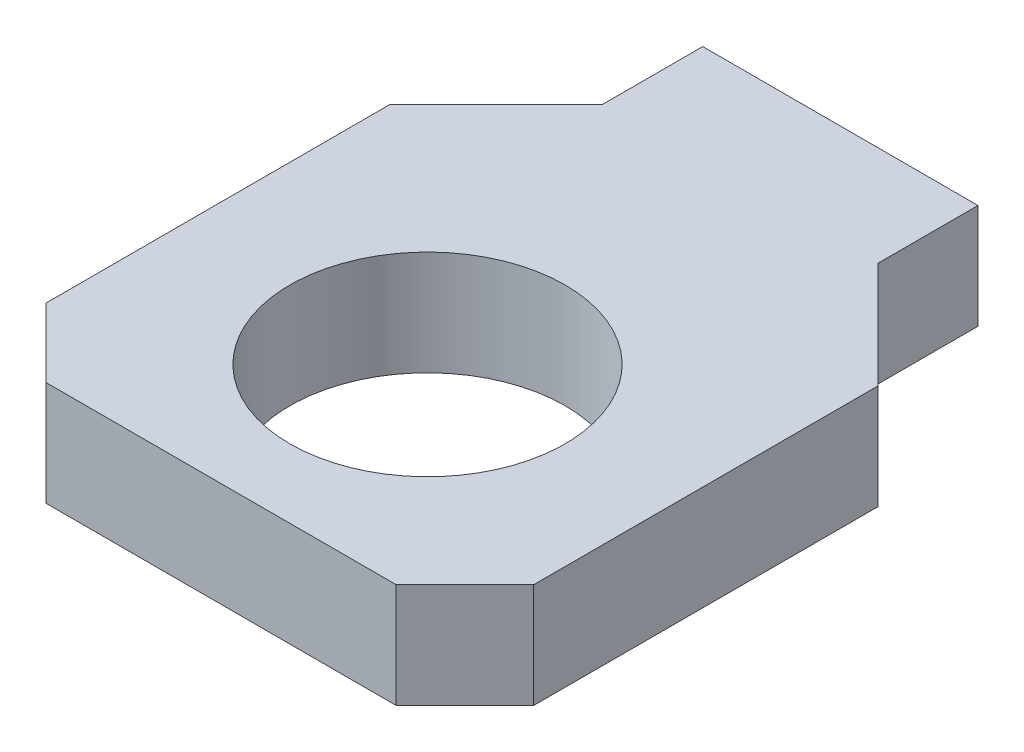
ISO-10303-21;
HEADER;
FILE_DESCRIPTION(('STEP AP214'),'2;1');
FILE_NAME('part.step','',(''),(''),'','','');
FILE_SCHEMA(('AUTOMOTIVE_DESIGN { 1 0 10303 214 1 1 1 1 }'));
ENDSEC;
DATA;
#1=APPLICATION_CONTEXT('core data for automotive mechanical design processes');
#2=APPLICATION_PROTOCOL_DEFINITION('international standard','automotive_design',2000,#1);
#3=PRODUCT_CONTEXT('',#1,'mechanical');
#4=PRODUCT('Part','Part','',(#3));
#5=PRODUCT_RELATED_PRODUCT_CATEGORY('part','',(#4));
#6=PRODUCT_DEFINITION_FORMATION('','',#4);
#7=PRODUCT_DEFINITION_CONTEXT('part definition',#1,'design');
#8=PRODUCT_DEFINITION('design','',#6,#7);
#9=PRODUCT_DEFINITION_SHAPE('','',#8);
#10=(LENGTH_UNIT() NAMED_UNIT(*) SI_UNIT(.MILLI.,.METRE.));
#11=(NAMED_UNIT(*) PLANE_ANGLE_UNIT() SI_UNIT($,.RADIAN.));
#12=(NAMED_UNIT(*) SI_UNIT($,.STERADIAN.) SOLID_ANGLE_UNIT());
#13=UNCERTAINTY_MEASURE_WITH_UNIT(LENGTH_MEASURE(1.E-05),#10,'distance_accuracy_value','');
#14=(GEOMETRIC_REPRESENTATION_CONTEXT(3) GLOBAL_UNCERTAINTY_ASSIGNED_CONTEXT((#13)) GLOBAL_UNIT_ASSIGNED_CONTEXT((#10,
#11,#12)) REPRESENTATION_CONTEXT('',''));
#15=CARTESIAN_POINT('',(0.,0.,0.));
#16=DIRECTION('',(0.,0.,1.));
#17=DIRECTION('',(1.,0.,0.));
#18=AXIS2_PLACEMENT_3D('',#15,#16,#17);
#19=CARTESIAN_POINT('',(-11.2522,-4.826,-14.2875));
#20=DIRECTION('',(0.,-1.,0.));
#21=DIRECTION('',(0.,0.,-1.));
#22=AXIS2_PLACEMENT_3D('',#19,#20,#21);
#23=PLANE('',#22);
#24=DIRECTION('',(0.,0.,1.));
#25=VECTOR('',#24,1.);
#26=CARTESIAN_POINT('',(11.2522,-4.826,-14.2875));
#27=LINE('',#26,#25);
#28=CARTESIAN_POINT('',(11.2522,-4.82600000000004,-4.7625));
#29=VERTEX_POINT('',#28);
#30=CARTESIAN_POINT('',(11.2522,-4.826,11.1125));
#31=VERTEX_POINT('',#30);
#32=EDGE_CURVE('E146',#29,#31,#27,.T.);
#33=ORIENTED_EDGE('',*,*,#32,.T.);
#34=DIRECTION('',(-0.707106781186548,0.,0.707106781186548));
#35=VECTOR('',#34,1.);
#36=CARTESIAN_POINT('',(8.0772,-4.826,14.2875));
#37=LINE('',#36,#35);
#38=CARTESIAN_POINT('',(8.0772,-4.826,14.2875));
#39=VERTEX_POINT('',#38);
#40=EDGE_CURVE('E141',#31,#39,#37,.T.);
#41=ORIENTED_EDGE('',*,*,#40,.T.);
#42=DIRECTION('',(-1.,0.,0.));
#43=VECTOR('',#42,1.);
#44=CARTESIAN_POINT('',(11.2522,-4.826,14.2875));
#45=LINE('',#44,#43);
#46=CARTESIAN_POINT('',(-8.0772,-4.826,14.2875));
#47=VERTEX_POINT('',#46);
#48=EDGE_CURVE('E136',#39,#47,#45,.T.);
#49=ORIENTED_EDGE('',*,*,#48,.T.);
#50=DIRECTION('',(-0.707106781186547,0.,-0.707106781186548));
#51=VECTOR('',#50,1.);
#52=CARTESIAN_POINT('',(-11.2522,-4.826,11.1125));
#53=LINE('',#52,#51);
#54=CARTESIAN_POINT('',(-11.2522,-4.826,11.1125));
#55=VERTEX_POINT('',#54);
#56=EDGE_CURVE('E131',#47,#55,#53,.T.);
#57=ORIENTED_EDGE('',*,*,#56,.T.);
#58=DIRECTION('',(0.,0.,-1.));
#59=VECTOR('',#58,1.);
#60=CARTESIAN_POINT('',(-11.2522,-4.826,14.2875));
#61=LINE('',#60,#59);
#62=CARTESIAN_POINT('',(-11.2522,-4.82600000000004,-4.7625));
#63=VERTEX_POINT('',#62);
#64=EDGE_CURVE('E108',#55,#63,#61,.T.);
#65=ORIENTED_EDGE('',*,*,#64,.T.);
#66=DIRECTION('',(-0.707106781186548,0.,0.707106781186548));
#67=VECTOR('',#66,1.);
#68=CARTESIAN_POINT('',(-11.2522,-4.82600000000005,-4.7625));
#69=LINE('',#68,#67);
#70=CARTESIAN_POINT('',(-6.35,-4.82600000000001,-9.6647));
#71=VERTEX_POINT('',#70);
#72=EDGE_CURVE('E104',#71,#63,#69,.T.);
#73=ORIENTED_EDGE('',*,*,#72,.F.);
#74=DIRECTION('',(0.,0.,1.));
#75=VECTOR('',#74,1.);
#76=CARTESIAN_POINT('',(-6.35,-4.826,-9.6647));
#77=LINE('',#76,#75);
#78=CARTESIAN_POINT('',(-6.35,-4.826,-14.2875));
#79=VERTEX_POINT('',#78);
#80=EDGE_CURVE('E95',#79,#71,#77,.T.);
#81=ORIENTED_EDGE('',*,*,#80,.F.);
#82=DIRECTION('',(1.,0.,0.));
#83=VECTOR('',#82,1.);
#84=CARTESIAN_POINT('',(-11.2522,-4.826,-14.2875));
#85=LINE('',#84,#83);
#86=CARTESIAN_POINT('',(6.35,-4.826,-14.2875));
#87=VERTEX_POINT('',#86);
#88=EDGE_CURVE('E90',#79,#87,#85,.T.);
#89=ORIENTED_EDGE('',*,*,#88,.T.);
#90=DIRECTION('',(0.,0.,1.));
#91=VECTOR('',#90,1.);
#92=CARTESIAN_POINT('',(6.35,-4.826,-9.6647));
#93=LINE('',#92,#91);
#94=CARTESIAN_POINT('',(6.35,-4.82600000000001,-9.6647));
#95=VERTEX_POINT('',#94);
#96=EDGE_CURVE('E156',#87,#95,#93,.T.);
#97=ORIENTED_EDGE('',*,*,#96,.T.);
#98=DIRECTION('',(0.707106781186548,0.,0.707106781186548));
#99=VECTOR('',#98,1.);
#100=CARTESIAN_POINT('',(11.2522,-4.82600000000005,-4.7625));
#101=LINE('',#100,#99);
#102=EDGE_CURVE('E151',#95,#29,#101,.T.);
#103=ORIENTED_EDGE('',*,*,#102,.T.);
#104=EDGE_LOOP('',(#33,#41,#49,#57,#65,#73,#81,#89,#97,#103));
#105=FACE_BOUND('',#104,.T.);
#106=CARTESIAN_POINT('',(0.,-4.826,4.7625));
#107=DIRECTION('',(0.,1.,0.));
#108=DIRECTION('',(0.,0.,1.));
#109=AXIS2_PLACEMENT_3D('',#106,#107,#108);
#110=CIRCLE('',#109,6.35);
#111=CARTESIAN_POINT('',(0.,-4.826,11.1125));
#112=VERTEX_POINT('',#111);
#113=EDGE_CURVE('E20',#112,#112,#110,.T.);
#114=ORIENTED_EDGE('',*,*,#113,.T.);
#115=EDGE_LOOP('',(#114));
#116=FACE_BOUND('',#115,.T.);
#117=ADVANCED_FACE('F17',(#105,#116),#23,.T.);
#118=CARTESIAN_POINT('',(0.,31.8655374488451,4.7625));
#119=DIRECTION('',(0.,1.,0.));
#120=DIRECTION('',(0.,0.,1.));
#121=AXIS2_PLACEMENT_3D('',#118,#119,#120);
#122=CYLINDRICAL_SURFACE('',#121,6.35);
#123=ORIENTED_EDGE('',*,*,#113,.F.);
#124=EDGE_LOOP('',(#123));
#125=FACE_BOUND('',#124,.T.);
#126=CARTESIAN_POINT('',(0.,0.,4.7625));
#127=DIRECTION('',(0.,1.,0.));
#128=DIRECTION('',(0.,0.,1.));
#129=AXIS2_PLACEMENT_3D('',#126,#127,#128);
#130=CIRCLE('',#129,6.35);
#131=CARTESIAN_POINT('',(0.,0.,11.1125));
#132=VERTEX_POINT('',#131);
#133=EDGE_CURVE('E119',#132,#132,#130,.T.);
#134=ORIENTED_EDGE('',*,*,#133,.T.);
#135=EDGE_LOOP('',(#134));
#136=FACE_BOUND('',#135,.T.);
#137=ADVANCED_FACE('F219',(#125,#136),#122,.F.);
#138=CARTESIAN_POINT('',(-11.2522,115.824,-4.7625));
#139=DIRECTION('',(-0.707106781186548,0.,-0.707106781186548));
#140=DIRECTION('',(-0.707106781186548,0.,0.707106781186548));
#141=AXIS2_PLACEMENT_3D('',#138,#139,#140);
#142=PLANE('',#141);
#143=ORIENTED_EDGE('',*,*,#72,.T.);
#144=DIRECTION('',(0.,1.,0.));
#145=VECTOR('',#144,1.);
#146=CARTESIAN_POINT('',(-11.2522,-4.826,-4.7625));
#147=LINE('',#146,#145);
#148=CARTESIAN_POINT('',(-11.2522,0.,-4.7625));
#149=VERTEX_POINT('',#148);
#150=EDGE_CURVE('E126',#63,#149,#147,.T.);
#151=ORIENTED_EDGE('',*,*,#150,.T.);
#152=DIRECTION('',(0.707106781186548,0.,-0.707106781186547));
#153=VECTOR('',#152,1.);
#154=CARTESIAN_POINT('',(-11.2522,0.,-4.7625));
#155=LINE('',#154,#153);
#156=CARTESIAN_POINT('',(-6.35,0.,-9.6647));
#157=VERTEX_POINT('',#156);
#158=EDGE_CURVE('E115',#149,#157,#155,.T.);
#159=ORIENTED_EDGE('',*,*,#158,.T.);
#160=DIRECTION('',(0.,1.,0.));
#161=VECTOR('',#160,1.);
#162=CARTESIAN_POINT('',(-6.35,115.824,-9.6647));
#163=LINE('',#162,#161);
#164=EDGE_CURVE('E100',#71,#157,#163,.T.);
#165=ORIENTED_EDGE('',*,*,#164,.F.);
#166=EDGE_LOOP('',(#143,#151,#159,#165));
#167=FACE_BOUND('',#166,.T.);
#168=ADVANCED_FACE('F114',(#167),#142,.T.);
#169=CARTESIAN_POINT('',(-6.35,115.824,-9.6647));
#170=DIRECTION('',(-1.,0.,0.));
#171=DIRECTION('',(0.,0.,1.));
#172=AXIS2_PLACEMENT_3D('',#169,#170,#171);
#173=PLANE('',#172);
#174=ORIENTED_EDGE('',*,*,#80,.T.);
#175=ORIENTED_EDGE('',*,*,#164,.T.);
#176=DIRECTION('',(0.,0.,-1.));
#177=VECTOR('',#176,1.);
#178=CARTESIAN_POINT('',(-6.35,0.,-14.2875));
#179=LINE('',#178,#177);
#180=CARTESIAN_POINT('',(-6.35,0.,-14.2875));
#181=VERTEX_POINT('',#180);
#182=EDGE_CURVE('E123',#157,#181,#179,.T.);
#183=ORIENTED_EDGE('',*,*,#182,.T.);
#184=DIRECTION('',(0.,1.,0.));
#185=VECTOR('',#184,1.);
#186=CARTESIAN_POINT('',(-6.35,-4.826,-14.2875));
#187=LINE('',#186,#185);
#188=EDGE_CURVE('E102',#181,#79,#187,.F.);
#189=ORIENTED_EDGE('',*,*,#188,.T.);
#190=EDGE_LOOP('',(#174,#175,#183,#189));
#191=FACE_BOUND('',#190,.T.);
#192=ADVANCED_FACE('F97',(#191),#173,.T.);
#193=CARTESIAN_POINT('',(-11.2522,-4.826,-14.2875));
#194=DIRECTION('',(0.,0.,1.));
#195=DIRECTION('',(1.,0.,0.));
#196=AXIS2_PLACEMENT_3D('',#193,#194,#195);
#197=PLANE('',#196);
#198=DIRECTION('',(1.,0.,0.));
#199=VECTOR('',#198,1.);
#200=CARTESIAN_POINT('',(-11.2522,0.,-14.2875));
#201=LINE('',#200,#199);
#202=CARTESIAN_POINT('',(6.35,0.,-14.2875));
#203=VERTEX_POINT('',#202);
#204=EDGE_CURVE('E162',#181,#203,#201,.T.);
#205=ORIENTED_EDGE('',*,*,#204,.T.);
#206=DIRECTION('',(0.,1.,0.));
#207=VECTOR('',#206,1.);
#208=CARTESIAN_POINT('',(6.35,115.824,-14.2875));
#209=LINE('',#208,#207);
#210=EDGE_CURVE('E158',#203,#87,#209,.F.);
#211=ORIENTED_EDGE('',*,*,#210,.T.);
#212=ORIENTED_EDGE('',*,*,#88,.F.);
#213=ORIENTED_EDGE('',*,*,#188,.F.);
#214=EDGE_LOOP('',(#205,#211,#212,#213));
#215=FACE_BOUND('',#214,.T.);
#216=ADVANCED_FACE('F160',(#215),#197,.F.);
#217=CARTESIAN_POINT('',(6.35,115.824,-9.6647));
#218=DIRECTION('',(-1.,0.,0.));
#219=DIRECTION('',(0.,0.,1.));
#220=AXIS2_PLACEMENT_3D('',#217,#218,#219);
#221=PLANE('',#220);
#222=ORIENTED_EDGE('',*,*,#96,.F.);
#223=ORIENTED_EDGE('',*,*,#210,.F.);
#224=DIRECTION('',(0.,0.,-1.));
#225=VECTOR('',#224,1.);
#226=CARTESIAN_POINT('',(6.35,0.,-14.2875));
#227=LINE('',#226,#225);
#228=CARTESIAN_POINT('',(6.35,0.,-9.6647));
#229=VERTEX_POINT('',#228);
#230=EDGE_CURVE('E168',#203,#229,#227,.F.);
#231=ORIENTED_EDGE('',*,*,#230,.T.);
#232=DIRECTION('',(0.,1.,0.));
#233=VECTOR('',#232,1.);
#234=CARTESIAN_POINT('',(6.35,115.824,-9.6647));
#235=LINE('',#234,#233);
#236=EDGE_CURVE('E153',#229,#95,#235,.F.);
#237=ORIENTED_EDGE('',*,*,#236,.T.);
#238=EDGE_LOOP('',(#222,#223,#231,#237));
#239=FACE_BOUND('',#238,.T.);
#240=ADVANCED_FACE('F167',(#239),#221,.F.);
#241=CARTESIAN_POINT('',(11.2522,115.824,-4.7625));
#242=DIRECTION('',(-0.707106781186548,0.,0.707106781186548));
#243=DIRECTION('',(0.707106781186548,0.,0.707106781186548));
#244=AXIS2_PLACEMENT_3D('',#241,#242,#243);
#245=PLANE('',#244);
#246=ORIENTED_EDGE('',*,*,#102,.F.);
#247=ORIENTED_EDGE('',*,*,#236,.F.);
#248=DIRECTION('',(0.707106781186548,0.,0.707106781186547));
#249=VECTOR('',#248,1.);
#250=CARTESIAN_POINT('',(6.35,0.,-9.6647));
#251=LINE('',#250,#249);
#252=CARTESIAN_POINT('',(11.2522,0.,-4.7625));
#253=VERTEX_POINT('',#252);
#254=EDGE_CURVE('E176',#229,#253,#251,.T.);
#255=ORIENTED_EDGE('',*,*,#254,.T.);
#256=DIRECTION('',(0.,1.,0.));
#257=VECTOR('',#256,1.);
#258=CARTESIAN_POINT('',(11.2522,-4.826,-4.7625));
#259=LINE('',#258,#257);
#260=EDGE_CURVE('E148',#253,#29,#259,.F.);
#261=ORIENTED_EDGE('',*,*,#260,.T.);
#262=EDGE_LOOP('',(#246,#247,#255,#261));
#263=FACE_BOUND('',#262,.T.);
#264=ADVANCED_FACE('F207',(#263),#245,.F.);
#265=CARTESIAN_POINT('',(11.2522,-4.826,-14.2875));
#266=DIRECTION('',(-1.,0.,0.));
#267=DIRECTION('',(0.,0.,1.));
#268=AXIS2_PLACEMENT_3D('',#265,#266,#267);
#269=PLANE('',#268);
#270=DIRECTION('',(0.,1.,0.));
#271=VECTOR('',#270,1.);
#272=CARTESIAN_POINT('',(11.2522,-4.826,11.1125));
#273=LINE('',#272,#271);
#274=CARTESIAN_POINT('',(11.2522,0.,11.1125));
#275=VERTEX_POINT('',#274);
#276=EDGE_CURVE('E143',#275,#31,#273,.F.);
#277=ORIENTED_EDGE('',*,*,#276,.T.);
#278=ORIENTED_EDGE('',*,*,#32,.F.);
#279=ORIENTED_EDGE('',*,*,#260,.F.);
#280=DIRECTION('',(0.,0.,-1.));
#281=VECTOR('',#280,1.);
#282=CARTESIAN_POINT('',(11.2522,0.,-14.2875));
#283=LINE('',#282,#281);
#284=EDGE_CURVE('E178',#253,#275,#283,.F.);
#285=ORIENTED_EDGE('',*,*,#284,.T.);
#286=EDGE_LOOP('',(#277,#278,#279,#285));
#287=FACE_BOUND('',#286,.T.);
#288=ADVANCED_FACE('F203',(#287),#269,.F.);
#289=CARTESIAN_POINT('',(8.0772,-4.826,14.2875));
#290=DIRECTION('',(-0.707106781186548,0.,-0.707106781186548));
#291=DIRECTION('',(-0.707106781186548,0.,0.707106781186548));
#292=AXIS2_PLACEMENT_3D('',#289,#290,#291);
#293=PLANE('',#292);
#294=ORIENTED_EDGE('',*,*,#276,.F.);
#295=DIRECTION('',(-0.707106781186547,0.,0.707106781186547));
#296=VECTOR('',#295,1.);
#297=CARTESIAN_POINT('',(11.2522,0.,11.1125));
#298=LINE('',#297,#296);
#299=CARTESIAN_POINT('',(8.0772,0.,14.2875));
#300=VERTEX_POINT('',#299);
#301=EDGE_CURVE('E314',#275,#300,#298,.T.);
#302=ORIENTED_EDGE('',*,*,#301,.T.);
#303=DIRECTION('',(0.,1.,0.));
#304=VECTOR('',#303,1.);
#305=CARTESIAN_POINT('',(8.0772,-4.826,14.2875));
#306=LINE('',#305,#304);
#307=EDGE_CURVE('E138',#300,#39,#306,.F.);
#308=ORIENTED_EDGE('',*,*,#307,.T.);
#309=ORIENTED_EDGE('',*,*,#40,.F.);
#310=EDGE_LOOP('',(#294,#302,#308,#309));
#311=FACE_BOUND('',#310,.T.);
#312=ADVANCED_FACE('F199',(#311),#293,.F.);
#313=CARTESIAN_POINT('',(11.2522,-4.826,14.2875));
#314=DIRECTION('',(0.,0.,-1.));
#315=DIRECTION('',(-1.,0.,0.));
#316=AXIS2_PLACEMENT_3D('',#313,#314,#315);
#317=PLANE('',#316);
#318=DIRECTION('',(0.,1.,0.));
#319=VECTOR('',#318,1.);
#320=CARTESIAN_POINT('',(-8.0772,-4.826,14.2875));
#321=LINE('',#320,#319);
#322=CARTESIAN_POINT('',(-8.0772,0.,14.2875));
#323=VERTEX_POINT('',#322);
#324=EDGE_CURVE('E133',#323,#47,#321,.F.);
#325=ORIENTED_EDGE('',*,*,#324,.T.);
#326=ORIENTED_EDGE('',*,*,#48,.F.);
#327=ORIENTED_EDGE('',*,*,#307,.F.);
#328=DIRECTION('',(1.,0.,0.));
#329=VECTOR('',#328,1.);
#330=CARTESIAN_POINT('',(-11.2522,0.,14.2875));
#331=LINE('',#330,#329);
#332=EDGE_CURVE('E317',#300,#323,#331,.F.);
#333=ORIENTED_EDGE('',*,*,#332,.T.);
#334=EDGE_LOOP('',(#325,#326,#327,#333));
#335=FACE_BOUND('',#334,.T.);
#336=ADVANCED_FACE('F193',(#335),#317,.F.);
#337=CARTESIAN_POINT('',(-11.2522,-4.826,11.1125));
#338=DIRECTION('',(0.707106781186548,0.,-0.707106781186547));
#339=DIRECTION('',(-0.707106781186547,0.,-0.707106781186548));
#340=AXIS2_PLACEMENT_3D('',#337,#338,#339);
#341=PLANE('',#340);
#342=ORIENTED_EDGE('',*,*,#324,.F.);
#343=DIRECTION('',(-0.707106781186547,0.,-0.707106781186547));
#344=VECTOR('',#343,1.);
#345=CARTESIAN_POINT('',(-8.0772,0.,14.2875));
#346=LINE('',#345,#344);
#347=CARTESIAN_POINT('',(-11.2522,0.,11.1125));
#348=VERTEX_POINT('',#347);
#349=EDGE_CURVE('E26',#323,#348,#346,.T.);
#350=ORIENTED_EDGE('',*,*,#349,.T.);
#351=DIRECTION('',(0.,1.,0.));
#352=VECTOR('',#351,1.);
#353=CARTESIAN_POINT('',(-11.2522,-4.826,11.1125));
#354=LINE('',#353,#352);
#355=EDGE_CURVE('E34',#348,#55,#354,.F.);
#356=ORIENTED_EDGE('',*,*,#355,.T.);
#357=ORIENTED_EDGE('',*,*,#56,.F.);
#358=EDGE_LOOP('',(#342,#350,#356,#357));
#359=FACE_BOUND('',#358,.T.);
#360=ADVANCED_FACE('F185',(#359),#341,.F.);
#361=CARTESIAN_POINT('',(-11.2522,-4.826,14.2875));
#362=DIRECTION('',(1.,0.,0.));
#363=DIRECTION('',(0.,0.,-1.));
#364=AXIS2_PLACEMENT_3D('',#361,#362,#363);
#365=PLANE('',#364);
#366=ORIENTED_EDGE('',*,*,#355,.F.);
#367=DIRECTION('',(0.,0.,-1.));
#368=VECTOR('',#367,1.);
#369=CARTESIAN_POINT('',(-11.2522,0.,-14.2875));
#370=LINE('',#369,#368);
#371=EDGE_CURVE('E11',#348,#149,#370,.T.);
#372=ORIENTED_EDGE('',*,*,#371,.T.);
#373=ORIENTED_EDGE('',*,*,#150,.F.);
#374=ORIENTED_EDGE('',*,*,#64,.F.);
#375=EDGE_LOOP('',(#366,#372,#373,#374));
#376=FACE_BOUND('',#375,.T.);
#377=ADVANCED_FACE('F183',(#376),#365,.F.);
#378=CARTESIAN_POINT('',(-11.2522,0.,-14.2875));
#379=DIRECTION('',(0.,-1.,0.));
#380=DIRECTION('',(0.,0.,-1.));
#381=AXIS2_PLACEMENT_3D('',#378,#379,#380);
#382=PLANE('',#381);
#383=ORIENTED_EDGE('',*,*,#349,.F.);
#384=ORIENTED_EDGE('',*,*,#332,.F.);
#385=ORIENTED_EDGE('',*,*,#301,.F.);
#386=ORIENTED_EDGE('',*,*,#284,.F.);
#387=ORIENTED_EDGE('',*,*,#254,.F.);
#388=ORIENTED_EDGE('',*,*,#230,.F.);
#389=ORIENTED_EDGE('',*,*,#204,.F.);
#390=ORIENTED_EDGE('',*,*,#182,.F.);
#391=ORIENTED_EDGE('',*,*,#158,.F.);
#392=ORIENTED_EDGE('',*,*,#371,.F.);
#393=EDGE_LOOP('',(#383,#384,#385,#386,#387,#388,#389,#390,#391,#392));
#394=FACE_BOUND('',#393,.T.);
#395=ORIENTED_EDGE('',*,*,#133,.F.);
#396=EDGE_LOOP('',(#395));
#397=FACE_BOUND('',#396,.T.);
#398=ADVANCED_FACE('F172',(#394,#397),#382,.F.);
#399=CLOSED_SHELL('',(#117,#137,#168,#192,#216,#240,#264,#288,#312,#336,#360,#377,#398));
#400=MANIFOLD_SOLID_BREP('B1',#399);
#401=ADVANCED_BREP_SHAPE_REPRESENTATION('',(#18,#400),#14);
#402=SHAPE_DEFINITION_REPRESENTATION(#9,#401);
ENDSEC;
END-ISO-10303-21;
